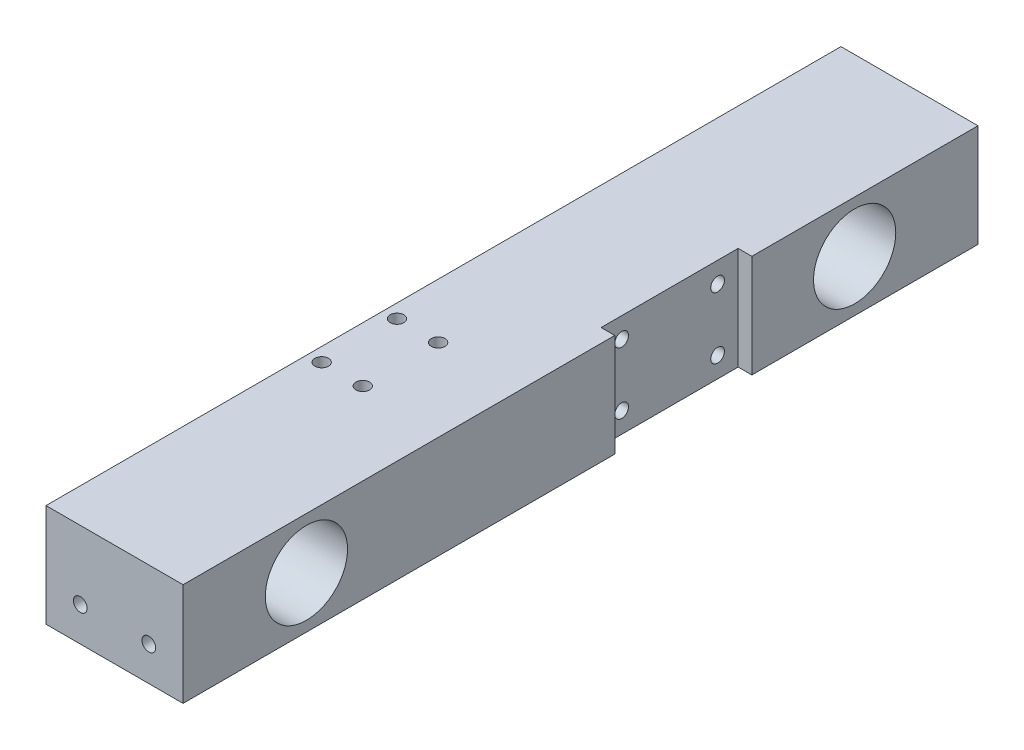
ISO-10303-21;
HEADER;
FILE_DESCRIPTION(('STEP AP214'),'2;1');
FILE_NAME('part.step','',(''),(''),'','','');
FILE_SCHEMA(('AUTOMOTIVE_DESIGN { 1 0 10303 214 1 1 1 1 }'));
ENDSEC;
DATA;
#1=APPLICATION_CONTEXT('core data for automotive mechanical design processes');
#2=APPLICATION_PROTOCOL_DEFINITION('international standard','automotive_design',2000,#1);
#3=PRODUCT_CONTEXT('',#1,'mechanical');
#4=PRODUCT('Part','Part','',(#3));
#5=PRODUCT_RELATED_PRODUCT_CATEGORY('part','',(#4));
#6=PRODUCT_DEFINITION_FORMATION('','',#4);
#7=PRODUCT_DEFINITION_CONTEXT('part definition',#1,'design');
#8=PRODUCT_DEFINITION('design','',#6,#7);
#9=PRODUCT_DEFINITION_SHAPE('','',#8);
#10=(LENGTH_UNIT() NAMED_UNIT(*) SI_UNIT(.MILLI.,.METRE.));
#11=(NAMED_UNIT(*) PLANE_ANGLE_UNIT() SI_UNIT($,.RADIAN.));
#12=(NAMED_UNIT(*) SI_UNIT($,.STERADIAN.) SOLID_ANGLE_UNIT());
#13=UNCERTAINTY_MEASURE_WITH_UNIT(LENGTH_MEASURE(1.E-05),#10,'distance_accuracy_value','');
#14=(GEOMETRIC_REPRESENTATION_CONTEXT(3) GLOBAL_UNCERTAINTY_ASSIGNED_CONTEXT((#13)) GLOBAL_UNIT_ASSIGNED_CONTEXT((#10,
#11,#12)) REPRESENTATION_CONTEXT('',''));
#15=CARTESIAN_POINT('',(0.,0.,0.));
#16=DIRECTION('',(0.,0.,1.));
#17=DIRECTION('',(1.,0.,0.));
#18=AXIS2_PLACEMENT_3D('',#15,#16,#17);
#19=CARTESIAN_POINT('',(0.,12.,50.));
#20=DIRECTION('',(1.,0.,0.));
#21=DIRECTION('',(0.,0.,-1.));
#22=AXIS2_PLACEMENT_3D('',#19,#20,#21);
#23=CYLINDRICAL_SURFACE('',#22,0.999999999999998);
#24=CARTESIAN_POINT('',(5.,12.,50.));
#25=DIRECTION('',(-1.,0.,0.));
#26=DIRECTION('',(0.,-1.,0.));
#27=AXIS2_PLACEMENT_3D('',#24,#25,#26);
#28=CIRCLE('',#27,0.999999999999998);
#29=CARTESIAN_POINT('',(5.,11.,50.));
#30=VERTEX_POINT('',#29);
#31=EDGE_CURVE('E37',#30,#30,#28,.F.);
#32=ORIENTED_EDGE('',*,*,#31,.F.);
#33=EDGE_LOOP('',(#32));
#34=FACE_BOUND('',#33,.T.);
#35=CARTESIAN_POINT('',(18.,12.,50.));
#36=DIRECTION('',(1.,0.,0.));
#37=DIRECTION('',(0.,0.,-1.));
#38=AXIS2_PLACEMENT_3D('',#35,#36,#37);
#39=CIRCLE('',#38,0.999999999999998);
#40=CARTESIAN_POINT('',(18.,12.,49.));
#41=VERTEX_POINT('',#40);
#42=EDGE_CURVE('E126',#41,#41,#39,.T.);
#43=ORIENTED_EDGE('',*,*,#42,.T.);
#44=EDGE_LOOP('',(#43));
#45=FACE_BOUND('',#44,.T.);
#46=ADVANCED_FACE('F33',(#34,#45),#23,.F.);
#47=CARTESIAN_POINT('',(0.,12.,36.));
#48=DIRECTION('',(1.,0.,0.));
#49=DIRECTION('',(0.,0.,-1.));
#50=AXIS2_PLACEMENT_3D('',#47,#48,#49);
#51=CYLINDRICAL_SURFACE('',#50,0.999999999999998);
#52=CARTESIAN_POINT('',(5.,12.,36.));
#53=DIRECTION('',(-1.,0.,0.));
#54=DIRECTION('',(0.,-1.,0.));
#55=AXIS2_PLACEMENT_3D('',#52,#53,#54);
#56=CIRCLE('',#55,0.999999999999998);
#57=CARTESIAN_POINT('',(5.,11.,36.));
#58=VERTEX_POINT('',#57);
#59=EDGE_CURVE('E291',#58,#58,#56,.T.);
#60=ORIENTED_EDGE('',*,*,#59,.T.);
#61=EDGE_LOOP('',(#60));
#62=FACE_BOUND('',#61,.T.);
#63=CARTESIAN_POINT('',(18.,12.,36.));
#64=DIRECTION('',(1.,0.,0.));
#65=DIRECTION('',(0.,0.,-1.));
#66=AXIS2_PLACEMENT_3D('',#63,#64,#65);
#67=CIRCLE('',#66,0.999999999999998);
#68=CARTESIAN_POINT('',(18.,12.,35.));
#69=VERTEX_POINT('',#68);
#70=EDGE_CURVE('E135',#69,#69,#67,.F.);
#71=ORIENTED_EDGE('',*,*,#70,.F.);
#72=EDGE_LOOP('',(#71));
#73=FACE_BOUND('',#72,.T.);
#74=ADVANCED_FACE('F302',(#62,#73),#51,.F.);
#75=CARTESIAN_POINT('',(0.,3.,36.));
#76=DIRECTION('',(1.,0.,0.));
#77=DIRECTION('',(0.,0.,-1.));
#78=AXIS2_PLACEMENT_3D('',#75,#76,#77);
#79=CYLINDRICAL_SURFACE('',#78,0.999999999999998);
#80=CARTESIAN_POINT('',(5.,3.,36.));
#81=DIRECTION('',(-1.,0.,0.));
#82=DIRECTION('',(0.,-1.,0.));
#83=AXIS2_PLACEMENT_3D('',#80,#81,#82);
#84=CIRCLE('',#83,0.999999999999998);
#85=CARTESIAN_POINT('',(5.,2.,36.));
#86=VERTEX_POINT('',#85);
#87=EDGE_CURVE('E289',#86,#86,#84,.F.);
#88=ORIENTED_EDGE('',*,*,#87,.F.);
#89=EDGE_LOOP('',(#88));
#90=FACE_BOUND('',#89,.T.);
#91=CARTESIAN_POINT('',(18.,3.,36.));
#92=DIRECTION('',(1.,0.,0.));
#93=DIRECTION('',(0.,0.,-1.));
#94=AXIS2_PLACEMENT_3D('',#91,#92,#93);
#95=CIRCLE('',#94,0.999999999999998);
#96=CARTESIAN_POINT('',(18.,3.,35.));
#97=VERTEX_POINT('',#96);
#98=EDGE_CURVE('E118',#97,#97,#95,.T.);
#99=ORIENTED_EDGE('',*,*,#98,.T.);
#100=EDGE_LOOP('',(#99));
#101=FACE_BOUND('',#100,.T.);
#102=ADVANCED_FACE('F352',(#90,#101),#79,.F.);
#103=CARTESIAN_POINT('',(0.,3.,50.));
#104=DIRECTION('',(1.,0.,0.));
#105=DIRECTION('',(0.,0.,-1.));
#106=AXIS2_PLACEMENT_3D('',#103,#104,#105);
#107=CYLINDRICAL_SURFACE('',#106,0.999999999999998);
#108=CARTESIAN_POINT('',(5.,3.,50.));
#109=DIRECTION('',(-1.,0.,0.));
#110=DIRECTION('',(0.,-1.,0.));
#111=AXIS2_PLACEMENT_3D('',#108,#109,#110);
#112=CIRCLE('',#111,0.999999999999998);
#113=CARTESIAN_POINT('',(5.,2.,50.));
#114=VERTEX_POINT('',#113);
#115=EDGE_CURVE('E174',#114,#114,#112,.T.);
#116=ORIENTED_EDGE('',*,*,#115,.T.);
#117=EDGE_LOOP('',(#116));
#118=FACE_BOUND('',#117,.T.);
#119=CARTESIAN_POINT('',(18.,3.,50.));
#120=DIRECTION('',(1.,0.,0.));
#121=DIRECTION('',(0.,0.,-1.));
#122=AXIS2_PLACEMENT_3D('',#119,#120,#121);
#123=CIRCLE('',#122,0.999999999999998);
#124=CARTESIAN_POINT('',(18.,3.,49.));
#125=VERTEX_POINT('',#124);
#126=EDGE_CURVE('E138',#125,#125,#123,.F.);
#127=ORIENTED_EDGE('',*,*,#126,.F.);
#128=EDGE_LOOP('',(#127));
#129=FACE_BOUND('',#128,.T.);
#130=ADVANCED_FACE('F355',(#118,#129),#107,.F.);
#131=CARTESIAN_POINT('',(20.,0.,116.));
#132=DIRECTION('',(-1.,0.,0.));
#133=DIRECTION('',(0.,0.,1.));
#134=AXIS2_PLACEMENT_3D('',#131,#132,#133);
#135=PLANE('',#134);
#136=CARTESIAN_POINT('',(20.,7.50000000000001,98.));
#137=DIRECTION('',(1.,0.,0.));
#138=DIRECTION('',(0.,0.,-1.));
#139=AXIS2_PLACEMENT_3D('',#136,#137,#138);
#140=CIRCLE('',#139,6.);
#141=CARTESIAN_POINT('',(20.,7.50000000000001,92.));
#142=VERTEX_POINT('',#141);
#143=EDGE_CURVE('E220',#142,#142,#140,.T.);
#144=ORIENTED_EDGE('',*,*,#143,.F.);
#145=EDGE_LOOP('',(#144));
#146=FACE_BOUND('',#145,.T.);
#147=DIRECTION('',(0.,1.,0.));
#148=VECTOR('',#147,1.);
#149=CARTESIAN_POINT('',(20.,0.,53.));
#150=LINE('',#149,#148);
#151=CARTESIAN_POINT('',(20.,0.,53.));
#152=VERTEX_POINT('',#151);
#153=CARTESIAN_POINT('',(20.,15.,53.));
#154=VERTEX_POINT('',#153);
#155=EDGE_CURVE('E113',#152,#154,#150,.T.);
#156=ORIENTED_EDGE('',*,*,#155,.T.);
#157=DIRECTION('',(0.,0.,-1.));
#158=VECTOR('',#157,1.);
#159=CARTESIAN_POINT('',(20.,15.,116.));
#160=LINE('',#159,#158);
#161=CARTESIAN_POINT('',(20.,15.,116.));
#162=VERTEX_POINT('',#161);
#163=EDGE_CURVE('E272',#162,#154,#160,.T.);
#164=ORIENTED_EDGE('',*,*,#163,.F.);
#165=DIRECTION('',(0.,1.,0.));
#166=VECTOR('',#165,1.);
#167=CARTESIAN_POINT('',(20.,0.,116.));
#168=LINE('',#167,#166);
#169=CARTESIAN_POINT('',(20.,0.,116.));
#170=VERTEX_POINT('',#169);
#171=EDGE_CURVE('E257',#170,#162,#168,.T.);
#172=ORIENTED_EDGE('',*,*,#171,.F.);
#173=DIRECTION('',(0.,0.,-1.));
#174=VECTOR('',#173,1.);
#175=CARTESIAN_POINT('',(20.,0.,116.));
#176=LINE('',#175,#174);
#177=EDGE_CURVE('E42',#170,#152,#176,.T.);
#178=ORIENTED_EDGE('',*,*,#177,.T.);
#179=EDGE_LOOP('',(#156,#164,#172,#178));
#180=FACE_BOUND('',#179,.T.);
#181=ADVANCED_FACE('F358',(#146,#180),#135,.F.);
#182=CARTESIAN_POINT('',(0.,0.,116.));
#183=DIRECTION('',(0.,1.,0.));
#184=DIRECTION('',(0.,0.,1.));
#185=AXIS2_PLACEMENT_3D('',#182,#183,#184);
#186=PLANE('',#185);
#187=CARTESIAN_POINT('',(2.,0.,77.78));
#188=DIRECTION('',(0.,-1.,0.));
#189=DIRECTION('',(0.,0.,-1.));
#190=AXIS2_PLACEMENT_3D('',#187,#188,#189);
#191=CIRCLE('',#190,1.5);
#192=CARTESIAN_POINT('',(2.,0.,76.28));
#193=VERTEX_POINT('',#192);
#194=EDGE_CURVE('E180',#193,#193,#191,.T.);
#195=ORIENTED_EDGE('',*,*,#194,.F.);
#196=EDGE_LOOP('',(#195));
#197=FACE_BOUND('',#196,.T.);
#198=CARTESIAN_POINT('',(8.,0.,77.78));
#199=DIRECTION('',(0.,-1.,0.));
#200=DIRECTION('',(0.,0.,-1.));
#201=AXIS2_PLACEMENT_3D('',#198,#199,#200);
#202=CIRCLE('',#201,1.5);
#203=CARTESIAN_POINT('',(8.,0.,76.28));
#204=VERTEX_POINT('',#203);
#205=EDGE_CURVE('E177',#204,#204,#202,.T.);
#206=ORIENTED_EDGE('',*,*,#205,.F.);
#207=EDGE_LOOP('',(#206));
#208=FACE_BOUND('',#207,.T.);
#209=CARTESIAN_POINT('',(8.,0.,66.78));
#210=DIRECTION('',(0.,-1.,0.));
#211=DIRECTION('',(0.,0.,-1.));
#212=AXIS2_PLACEMENT_3D('',#209,#210,#211);
#213=CIRCLE('',#212,1.5);
#214=CARTESIAN_POINT('',(8.,0.,65.28));
#215=VERTEX_POINT('',#214);
#216=EDGE_CURVE('E184',#215,#215,#213,.T.);
#217=ORIENTED_EDGE('',*,*,#216,.F.);
#218=EDGE_LOOP('',(#217));
#219=FACE_BOUND('',#218,.T.);
#220=CARTESIAN_POINT('',(2.,0.,66.78));
#221=DIRECTION('',(0.,-1.,0.));
#222=DIRECTION('',(0.,0.,-1.));
#223=AXIS2_PLACEMENT_3D('',#220,#221,#222);
#224=CIRCLE('',#223,1.5);
#225=CARTESIAN_POINT('',(2.,0.,65.28));
#226=VERTEX_POINT('',#225);
#227=EDGE_CURVE('E190',#226,#226,#224,.T.);
#228=ORIENTED_EDGE('',*,*,#227,.F.);
#229=EDGE_LOOP('',(#228));
#230=FACE_BOUND('',#229,.T.);
#231=DIRECTION('',(1.,0.,0.));
#232=VECTOR('',#231,1.);
#233=CARTESIAN_POINT('',(18.,0.,53.));
#234=LINE('',#233,#232);
#235=CARTESIAN_POINT('',(18.,0.,53.));
#236=VERTEX_POINT('',#235);
#237=EDGE_CURVE('E107',#236,#152,#234,.T.);
#238=ORIENTED_EDGE('',*,*,#237,.T.);
#239=ORIENTED_EDGE('',*,*,#177,.F.);
#240=DIRECTION('',(1.,0.,0.));
#241=VECTOR('',#240,1.);
#242=CARTESIAN_POINT('',(0.,0.,116.));
#243=LINE('',#242,#241);
#244=CARTESIAN_POINT('',(0.,0.,116.));
#245=VERTEX_POINT('',#244);
#246=EDGE_CURVE('E259',#245,#170,#243,.T.);
#247=ORIENTED_EDGE('',*,*,#246,.F.);
#248=DIRECTION('',(0.,0.,-1.));
#249=VECTOR('',#248,1.);
#250=CARTESIAN_POINT('',(0.,0.,116.));
#251=LINE('',#250,#249);
#252=CARTESIAN_POINT('',(0.,0.,0.));
#253=VERTEX_POINT('',#252);
#254=EDGE_CURVE('E11',#245,#253,#251,.T.);
#255=ORIENTED_EDGE('',*,*,#254,.T.);
#256=DIRECTION('',(1.,0.,0.));
#257=VECTOR('',#256,1.);
#258=CARTESIAN_POINT('',(0.,0.,0.));
#259=LINE('',#258,#257);
#260=CARTESIAN_POINT('',(20.,0.,0.));
#261=VERTEX_POINT('',#260);
#262=EDGE_CURVE('E255',#253,#261,#259,.T.);
#263=ORIENTED_EDGE('',*,*,#262,.T.);
#264=CARTESIAN_POINT('',(20.,0.,33.));
#265=VERTEX_POINT('',#264);
#266=EDGE_CURVE('E271',#265,#261,#176,.T.);
#267=ORIENTED_EDGE('',*,*,#266,.F.);
#268=DIRECTION('',(1.,0.,0.));
#269=VECTOR('',#268,1.);
#270=CARTESIAN_POINT('',(18.,0.,33.));
#271=LINE('',#270,#269);
#272=CARTESIAN_POINT('',(18.,0.,33.));
#273=VERTEX_POINT('',#272);
#274=EDGE_CURVE('E117',#273,#265,#271,.T.);
#275=ORIENTED_EDGE('',*,*,#274,.F.);
#276=DIRECTION('',(0.,0.,-1.));
#277=VECTOR('',#276,1.);
#278=CARTESIAN_POINT('',(18.,0.,0.));
#279=LINE('',#278,#277);
#280=EDGE_CURVE('E122',#236,#273,#279,.T.);
#281=ORIENTED_EDGE('',*,*,#280,.F.);
#282=EDGE_LOOP('',(#238,#239,#247,#255,#263,#267,#275,#281));
#283=FACE_BOUND('',#282,.T.);
#284=ADVANCED_FACE('F128',(#197,#208,#219,#230,#283),#186,.F.);
#285=CARTESIAN_POINT('',(0.,15.,116.));
#286=DIRECTION('',(0.,1.,0.));
#287=DIRECTION('',(-1.,0.,0.));
#288=AXIS2_PLACEMENT_3D('',#285,#286,#287);
#289=PLANE('',#288);
#290=CARTESIAN_POINT('',(8.,15.,66.78));
#291=DIRECTION('',(0.,-1.,0.));
#292=DIRECTION('',(1.,0.,0.));
#293=AXIS2_PLACEMENT_3D('',#290,#291,#292);
#294=CIRCLE('',#293,1.);
#295=CARTESIAN_POINT('',(9.00000000000001,15.,66.78));
#296=VERTEX_POINT('',#295);
#297=EDGE_CURVE('E206',#296,#296,#294,.T.);
#298=ORIENTED_EDGE('',*,*,#297,.T.);
#299=EDGE_LOOP('',(#298));
#300=FACE_BOUND('',#299,.T.);
#301=CARTESIAN_POINT('',(2.,15.,66.78));
#302=DIRECTION('',(0.,1.,0.));
#303=DIRECTION('',(-1.,0.,0.));
#304=AXIS2_PLACEMENT_3D('',#301,#302,#303);
#305=CIRCLE('',#304,1.);
#306=CARTESIAN_POINT('',(0.999999999999999,15.,66.78));
#307=VERTEX_POINT('',#306);
#308=EDGE_CURVE('E202',#307,#307,#305,.T.);
#309=ORIENTED_EDGE('',*,*,#308,.F.);
#310=EDGE_LOOP('',(#309));
#311=FACE_BOUND('',#310,.T.);
#312=CARTESIAN_POINT('',(8.,15.,77.78));
#313=DIRECTION('',(0.,1.,0.));
#314=DIRECTION('',(-1.,0.,0.));
#315=AXIS2_PLACEMENT_3D('',#312,#313,#314);
#316=CIRCLE('',#315,1.);
#317=CARTESIAN_POINT('',(7.,15.,77.78));
#318=VERTEX_POINT('',#317);
#319=EDGE_CURVE('E205',#318,#318,#316,.T.);
#320=ORIENTED_EDGE('',*,*,#319,.F.);
#321=EDGE_LOOP('',(#320));
#322=FACE_BOUND('',#321,.T.);
#323=CARTESIAN_POINT('',(2.,15.,77.78));
#324=DIRECTION('',(0.,-1.,0.));
#325=DIRECTION('',(1.,0.,0.));
#326=AXIS2_PLACEMENT_3D('',#323,#324,#325);
#327=CIRCLE('',#326,1.);
#328=CARTESIAN_POINT('',(3.,15.,77.78));
#329=VERTEX_POINT('',#328);
#330=EDGE_CURVE('E209',#329,#329,#327,.T.);
#331=ORIENTED_EDGE('',*,*,#330,.T.);
#332=EDGE_LOOP('',(#331));
#333=FACE_BOUND('',#332,.T.);
#334=ORIENTED_EDGE('',*,*,#163,.T.);
#335=DIRECTION('',(1.,0.,0.));
#336=VECTOR('',#335,1.);
#337=CARTESIAN_POINT('',(18.,15.,53.));
#338=LINE('',#337,#336);
#339=CARTESIAN_POINT('',(18.,15.,53.));
#340=VERTEX_POINT('',#339);
#341=EDGE_CURVE('E146',#340,#154,#338,.T.);
#342=ORIENTED_EDGE('',*,*,#341,.F.);
#343=DIRECTION('',(0.,0.,-1.));
#344=VECTOR('',#343,1.);
#345=CARTESIAN_POINT('',(18.,15.,0.));
#346=LINE('',#345,#344);
#347=CARTESIAN_POINT('',(18.,15.,33.));
#348=VERTEX_POINT('',#347);
#349=EDGE_CURVE('E125',#340,#348,#346,.T.);
#350=ORIENTED_EDGE('',*,*,#349,.T.);
#351=DIRECTION('',(1.,0.,0.));
#352=VECTOR('',#351,1.);
#353=CARTESIAN_POINT('',(18.,15.,33.));
#354=LINE('',#353,#352);
#355=CARTESIAN_POINT('',(20.,15.,33.));
#356=VERTEX_POINT('',#355);
#357=EDGE_CURVE('E149',#348,#356,#354,.T.);
#358=ORIENTED_EDGE('',*,*,#357,.T.);
#359=CARTESIAN_POINT('',(20.,15.,0.));
#360=VERTEX_POINT('',#359);
#361=EDGE_CURVE('E275',#356,#360,#160,.T.);
#362=ORIENTED_EDGE('',*,*,#361,.T.);
#363=DIRECTION('',(1.,0.,0.));
#364=VECTOR('',#363,1.);
#365=CARTESIAN_POINT('',(0.,15.,0.));
#366=LINE('',#365,#364);
#367=CARTESIAN_POINT('',(0.,15.,0.));
#368=VERTEX_POINT('',#367);
#369=EDGE_CURVE('E263',#368,#360,#366,.T.);
#370=ORIENTED_EDGE('',*,*,#369,.F.);
#371=DIRECTION('',(0.,0.,-1.));
#372=VECTOR('',#371,1.);
#373=CARTESIAN_POINT('',(0.,15.,116.));
#374=LINE('',#373,#372);
#375=CARTESIAN_POINT('',(0.,15.,116.));
#376=VERTEX_POINT('',#375);
#377=EDGE_CURVE('E83',#376,#368,#374,.T.);
#378=ORIENTED_EDGE('',*,*,#377,.F.);
#379=DIRECTION('',(1.,0.,0.));
#380=VECTOR('',#379,1.);
#381=CARTESIAN_POINT('',(0.,15.,116.));
#382=LINE('',#381,#380);
#383=EDGE_CURVE('E254',#376,#162,#382,.T.);
#384=ORIENTED_EDGE('',*,*,#383,.T.);
#385=EDGE_LOOP('',(#334,#342,#350,#358,#362,#370,#378,#384));
#386=FACE_BOUND('',#385,.T.);
#387=ADVANCED_FACE('F459',(#300,#311,#322,#333,#386),#289,.T.);
#388=CARTESIAN_POINT('',(0.,0.,116.));
#389=DIRECTION('',(-1.,0.,0.));
#390=DIRECTION('',(0.,-1.,0.));
#391=AXIS2_PLACEMENT_3D('',#388,#389,#390);
#392=PLANE('',#391);
#393=CARTESIAN_POINT('',(0.,12.,50.));
#394=DIRECTION('',(-1.,0.,0.));
#395=DIRECTION('',(0.,-1.,0.));
#396=AXIS2_PLACEMENT_3D('',#393,#394,#395);
#397=CIRCLE('',#396,2.);
#398=CARTESIAN_POINT('',(0.,10.,50.));
#399=VERTEX_POINT('',#398);
#400=EDGE_CURVE('E148',#399,#399,#397,.T.);
#401=ORIENTED_EDGE('',*,*,#400,.F.);
#402=EDGE_LOOP('',(#401));
#403=FACE_BOUND('',#402,.T.);
#404=CARTESIAN_POINT('',(0.,3.,50.));
#405=DIRECTION('',(-1.,0.,0.));
#406=DIRECTION('',(0.,-1.,0.));
#407=AXIS2_PLACEMENT_3D('',#404,#405,#406);
#408=CIRCLE('',#407,2.);
#409=CARTESIAN_POINT('',(0.,0.999999999999998,50.));
#410=VERTEX_POINT('',#409);
#411=EDGE_CURVE('E163',#410,#410,#408,.T.);
#412=ORIENTED_EDGE('',*,*,#411,.F.);
#413=EDGE_LOOP('',(#412));
#414=FACE_BOUND('',#413,.T.);
#415=CARTESIAN_POINT('',(0.,3.,36.));
#416=DIRECTION('',(-1.,0.,0.));
#417=DIRECTION('',(0.,-1.,0.));
#418=AXIS2_PLACEMENT_3D('',#415,#416,#417);
#419=CIRCLE('',#418,2.);
#420=CARTESIAN_POINT('',(0.,0.999999999999998,36.));
#421=VERTEX_POINT('',#420);
#422=EDGE_CURVE('E157',#421,#421,#419,.T.);
#423=ORIENTED_EDGE('',*,*,#422,.F.);
#424=EDGE_LOOP('',(#423));
#425=FACE_BOUND('',#424,.T.);
#426=CARTESIAN_POINT('',(0.,12.,36.));
#427=DIRECTION('',(-1.,0.,0.));
#428=DIRECTION('',(0.,-1.,0.));
#429=AXIS2_PLACEMENT_3D('',#426,#427,#428);
#430=CIRCLE('',#429,2.);
#431=CARTESIAN_POINT('',(0.,10.,36.));
#432=VERTEX_POINT('',#431);
#433=EDGE_CURVE('E156',#432,#432,#430,.T.);
#434=ORIENTED_EDGE('',*,*,#433,.F.);
#435=EDGE_LOOP('',(#434));
#436=FACE_BOUND('',#435,.T.);
#437=DIRECTION('',(0.,1.,0.));
#438=VECTOR('',#437,1.);
#439=CARTESIAN_POINT('',(0.,0.,0.));
#440=LINE('',#439,#438);
#441=EDGE_CURVE('E243',#253,#368,#440,.T.);
#442=ORIENTED_EDGE('',*,*,#441,.F.);
#443=ORIENTED_EDGE('',*,*,#254,.F.);
#444=DIRECTION('',(0.,1.,0.));
#445=VECTOR('',#444,1.);
#446=CARTESIAN_POINT('',(0.,0.,116.));
#447=LINE('',#446,#445);
#448=EDGE_CURVE('E252',#245,#376,#447,.T.);
#449=ORIENTED_EDGE('',*,*,#448,.T.);
#450=ORIENTED_EDGE('',*,*,#377,.T.);
#451=EDGE_LOOP('',(#442,#443,#449,#450));
#452=FACE_BOUND('',#451,.T.);
#453=CARTESIAN_POINT('',(0.,7.50000000000002,18.));
#454=DIRECTION('',(1.,0.,0.));
#455=DIRECTION('',(0.,0.,-1.));
#456=AXIS2_PLACEMENT_3D('',#453,#454,#455);
#457=CIRCLE('',#456,6.);
#458=CARTESIAN_POINT('',(0.,7.50000000000002,12.));
#459=VERTEX_POINT('',#458);
#460=EDGE_CURVE('E223',#459,#459,#457,.F.);
#461=ORIENTED_EDGE('',*,*,#460,.F.);
#462=EDGE_LOOP('',(#461));
#463=FACE_BOUND('',#462,.T.);
#464=CARTESIAN_POINT('',(0.,7.50000000000001,98.));
#465=DIRECTION('',(1.,0.,0.));
#466=DIRECTION('',(0.,0.,-1.));
#467=AXIS2_PLACEMENT_3D('',#464,#465,#466);
#468=CIRCLE('',#467,6.);
#469=CARTESIAN_POINT('',(0.,7.50000000000001,92.));
#470=VERTEX_POINT('',#469);
#471=EDGE_CURVE('E216',#470,#470,#468,.T.);
#472=ORIENTED_EDGE('',*,*,#471,.T.);
#473=EDGE_LOOP('',(#472));
#474=FACE_BOUND('',#473,.T.);
#475=ADVANCED_FACE('F35',(#403,#414,#425,#436,#452,#463,#474),#392,.T.);
#476=ORIENTED_EDGE('',*,*,#361,.F.);
#477=DIRECTION('',(0.,1.,0.));
#478=VECTOR('',#477,1.);
#479=CARTESIAN_POINT('',(20.,0.,33.));
#480=LINE('',#479,#478);
#481=EDGE_CURVE('E144',#265,#356,#480,.T.);
#482=ORIENTED_EDGE('',*,*,#481,.F.);
#483=ORIENTED_EDGE('',*,*,#266,.T.);
#484=DIRECTION('',(0.,1.,0.));
#485=VECTOR('',#484,1.);
#486=CARTESIAN_POINT('',(20.,0.,0.));
#487=LINE('',#486,#485);
#488=EDGE_CURVE('E266',#261,#360,#487,.T.);
#489=ORIENTED_EDGE('',*,*,#488,.T.);
#490=EDGE_LOOP('',(#476,#482,#483,#489));
#491=FACE_BOUND('',#490,.T.);
#492=CARTESIAN_POINT('',(20.,7.50000000000002,18.));
#493=DIRECTION('',(1.,0.,0.));
#494=DIRECTION('',(0.,0.,-1.));
#495=AXIS2_PLACEMENT_3D('',#492,#493,#494);
#496=CIRCLE('',#495,6.);
#497=CARTESIAN_POINT('',(20.,7.50000000000002,12.));
#498=VERTEX_POINT('',#497);
#499=EDGE_CURVE('E215',#498,#498,#496,.F.);
#500=ORIENTED_EDGE('',*,*,#499,.T.);
#501=EDGE_LOOP('',(#500));
#502=FACE_BOUND('',#501,.T.);
#503=ADVANCED_FACE('F409',(#491,#502),#135,.F.);
#504=CARTESIAN_POINT('',(8.,0.,77.78));
#505=DIRECTION('',(0.,1.,0.));
#506=DIRECTION('',(-1.,0.,0.));
#507=AXIS2_PLACEMENT_3D('',#504,#505,#506);
#508=CYLINDRICAL_SURFACE('',#507,1.);
#509=ORIENTED_EDGE('',*,*,#319,.T.);
#510=EDGE_LOOP('',(#509));
#511=FACE_BOUND('',#510,.T.);
#512=CARTESIAN_POINT('',(8.,5.,77.78));
#513=DIRECTION('',(0.,-1.,0.));
#514=DIRECTION('',(0.,0.,-1.));
#515=AXIS2_PLACEMENT_3D('',#512,#513,#514);
#516=CIRCLE('',#515,1.);
#517=CARTESIAN_POINT('',(8.,5.,76.78));
#518=VERTEX_POINT('',#517);
#519=EDGE_CURVE('E212',#518,#518,#516,.F.);
#520=ORIENTED_EDGE('',*,*,#519,.F.);
#521=EDGE_LOOP('',(#520));
#522=FACE_BOUND('',#521,.T.);
#523=ADVANCED_FACE('F397',(#511,#522),#508,.F.);
#524=CARTESIAN_POINT('',(2.,0.,66.78));
#525=DIRECTION('',(0.,1.,0.));
#526=DIRECTION('',(-1.,0.,0.));
#527=AXIS2_PLACEMENT_3D('',#524,#525,#526);
#528=CYLINDRICAL_SURFACE('',#527,1.);
#529=ORIENTED_EDGE('',*,*,#308,.T.);
#530=EDGE_LOOP('',(#529));
#531=FACE_BOUND('',#530,.T.);
#532=CARTESIAN_POINT('',(2.,5.,66.78));
#533=DIRECTION('',(0.,-1.,0.));
#534=DIRECTION('',(0.,0.,-1.));
#535=AXIS2_PLACEMENT_3D('',#532,#533,#534);
#536=CIRCLE('',#535,1.);
#537=CARTESIAN_POINT('',(2.,5.,65.78));
#538=VERTEX_POINT('',#537);
#539=EDGE_CURVE('E282',#538,#538,#536,.F.);
#540=ORIENTED_EDGE('',*,*,#539,.F.);
#541=EDGE_LOOP('',(#540));
#542=FACE_BOUND('',#541,.T.);
#543=ADVANCED_FACE('F393',(#531,#542),#528,.F.);
#544=CARTESIAN_POINT('',(8.,0.,66.78));
#545=DIRECTION('',(0.,1.,0.));
#546=DIRECTION('',(-1.,0.,0.));
#547=AXIS2_PLACEMENT_3D('',#544,#545,#546);
#548=CYLINDRICAL_SURFACE('',#547,1.);
#549=ORIENTED_EDGE('',*,*,#297,.F.);
#550=EDGE_LOOP('',(#549));
#551=FACE_BOUND('',#550,.T.);
#552=CARTESIAN_POINT('',(8.,5.,66.78));
#553=DIRECTION('',(0.,-1.,0.));
#554=DIRECTION('',(0.,0.,-1.));
#555=AXIS2_PLACEMENT_3D('',#552,#553,#554);
#556=CIRCLE('',#555,1.);
#557=CARTESIAN_POINT('',(8.,5.,65.78));
#558=VERTEX_POINT('',#557);
#559=EDGE_CURVE('E279',#558,#558,#556,.T.);
#560=ORIENTED_EDGE('',*,*,#559,.T.);
#561=EDGE_LOOP('',(#560));
#562=FACE_BOUND('',#561,.T.);
#563=ADVANCED_FACE('F396',(#551,#562),#548,.F.);
#564=CARTESIAN_POINT('',(2.,0.,77.78));
#565=DIRECTION('',(0.,1.,0.));
#566=DIRECTION('',(-1.,0.,0.));
#567=AXIS2_PLACEMENT_3D('',#564,#565,#566);
#568=CYLINDRICAL_SURFACE('',#567,1.);
#569=ORIENTED_EDGE('',*,*,#330,.F.);
#570=EDGE_LOOP('',(#569));
#571=FACE_BOUND('',#570,.T.);
#572=CARTESIAN_POINT('',(2.,5.,77.78));
#573=DIRECTION('',(0.,-1.,0.));
#574=DIRECTION('',(0.,0.,-1.));
#575=AXIS2_PLACEMENT_3D('',#572,#573,#574);
#576=CIRCLE('',#575,1.);
#577=CARTESIAN_POINT('',(2.,5.,76.78));
#578=VERTEX_POINT('',#577);
#579=EDGE_CURVE('E199',#578,#578,#576,.T.);
#580=ORIENTED_EDGE('',*,*,#579,.T.);
#581=EDGE_LOOP('',(#580));
#582=FACE_BOUND('',#581,.T.);
#583=ADVANCED_FACE('F401',(#571,#582),#568,.F.);
#584=CARTESIAN_POINT('',(0.,0.,116.));
#585=DIRECTION('',(0.,0.,-1.));
#586=DIRECTION('',(-1.,0.,0.));
#587=AXIS2_PLACEMENT_3D('',#584,#585,#586);
#588=PLANE('',#587);
#589=CARTESIAN_POINT('',(5.,5.00000000000001,116.));
#590=DIRECTION('',(0.,0.,1.));
#591=DIRECTION('',(1.,0.,0.));
#592=AXIS2_PLACEMENT_3D('',#589,#590,#591);
#593=CIRCLE('',#592,1.);
#594=CARTESIAN_POINT('',(6.,5.00000000000001,116.));
#595=VERTEX_POINT('',#594);
#596=EDGE_CURVE('E235',#595,#595,#593,.T.);
#597=ORIENTED_EDGE('',*,*,#596,.F.);
#598=EDGE_LOOP('',(#597));
#599=FACE_BOUND('',#598,.T.);
#600=ORIENTED_EDGE('',*,*,#448,.F.);
#601=ORIENTED_EDGE('',*,*,#246,.T.);
#602=ORIENTED_EDGE('',*,*,#171,.T.);
#603=ORIENTED_EDGE('',*,*,#383,.F.);
#604=EDGE_LOOP('',(#600,#601,#602,#603));
#605=FACE_BOUND('',#604,.T.);
#606=CARTESIAN_POINT('',(15.,5.00000000000001,116.));
#607=DIRECTION('',(0.,0.,-1.));
#608=DIRECTION('',(-1.,0.,0.));
#609=AXIS2_PLACEMENT_3D('',#606,#607,#608);
#610=CIRCLE('',#609,1.);
#611=CARTESIAN_POINT('',(14.,5.00000000000001,116.));
#612=VERTEX_POINT('',#611);
#613=EDGE_CURVE('E232',#612,#612,#610,.T.);
#614=ORIENTED_EDGE('',*,*,#613,.T.);
#615=EDGE_LOOP('',(#614));
#616=FACE_BOUND('',#615,.T.);
#617=ADVANCED_FACE('F405',(#599,#605,#616),#588,.F.);
#618=CARTESIAN_POINT('',(0.,0.,0.));
#619=DIRECTION('',(0.,0.,-1.));
#620=DIRECTION('',(-1.,0.,0.));
#621=AXIS2_PLACEMENT_3D('',#618,#619,#620);
#622=PLANE('',#621);
#623=ORIENTED_EDGE('',*,*,#441,.T.);
#624=ORIENTED_EDGE('',*,*,#369,.T.);
#625=ORIENTED_EDGE('',*,*,#488,.F.);
#626=ORIENTED_EDGE('',*,*,#262,.F.);
#627=EDGE_LOOP('',(#623,#624,#625,#626));
#628=FACE_BOUND('',#627,.T.);
#629=CARTESIAN_POINT('',(5.,5.00000000000001,0.));
#630=DIRECTION('',(0.,0.,-1.));
#631=DIRECTION('',(-1.,0.,0.));
#632=AXIS2_PLACEMENT_3D('',#629,#630,#631);
#633=CIRCLE('',#632,1.);
#634=CARTESIAN_POINT('',(4.,5.00000000000001,0.));
#635=VERTEX_POINT('',#634);
#636=EDGE_CURVE('E247',#635,#635,#633,.T.);
#637=ORIENTED_EDGE('',*,*,#636,.F.);
#638=EDGE_LOOP('',(#637));
#639=FACE_BOUND('',#638,.T.);
#640=CARTESIAN_POINT('',(15.,5.00000000000001,0.));
#641=DIRECTION('',(0.,0.,1.));
#642=DIRECTION('',(1.,0.,0.));
#643=AXIS2_PLACEMENT_3D('',#640,#641,#642);
#644=CIRCLE('',#643,1.);
#645=CARTESIAN_POINT('',(16.,5.00000000000001,0.));
#646=VERTEX_POINT('',#645);
#647=EDGE_CURVE('E244',#646,#646,#644,.T.);
#648=ORIENTED_EDGE('',*,*,#647,.T.);
#649=EDGE_LOOP('',(#648));
#650=FACE_BOUND('',#649,.T.);
#651=ADVANCED_FACE('F446',(#628,#639,#650),#622,.T.);
#652=CARTESIAN_POINT('',(5.,5.00000000000001,10.));
#653=DIRECTION('',(0.,0.,-1.));
#654=DIRECTION('',(-1.,0.,0.));
#655=AXIS2_PLACEMENT_3D('',#652,#653,#654);
#656=CYLINDRICAL_SURFACE('',#655,1.);
#657=CARTESIAN_POINT('',(5.,5.00000000000001,10.));
#658=DIRECTION('',(0.,0.,-1.));
#659=DIRECTION('',(-1.,0.,0.));
#660=AXIS2_PLACEMENT_3D('',#657,#658,#659);
#661=CIRCLE('',#660,1.);
#662=CARTESIAN_POINT('',(4.,5.00000000000001,10.));
#663=VERTEX_POINT('',#662);
#664=EDGE_CURVE('E231',#663,#663,#661,.T.);
#665=ORIENTED_EDGE('',*,*,#664,.F.);
#666=EDGE_LOOP('',(#665));
#667=FACE_BOUND('',#666,.T.);
#668=ORIENTED_EDGE('',*,*,#636,.T.);
#669=EDGE_LOOP('',(#668));
#670=FACE_BOUND('',#669,.T.);
#671=ADVANCED_FACE('F443',(#667,#670),#656,.F.);
#672=CARTESIAN_POINT('',(5.,5.00000000000001,10.));
#673=DIRECTION('',(0.,0.,-1.));
#674=DIRECTION('',(-1.,0.,0.));
#675=AXIS2_PLACEMENT_3D('',#672,#673,#674);
#676=PLANE('',#675);
#677=ORIENTED_EDGE('',*,*,#664,.T.);
#678=EDGE_LOOP('',(#677));
#679=FACE_BOUND('',#678,.T.);
#680=ADVANCED_FACE('F441',(#679),#676,.T.);
#681=CARTESIAN_POINT('',(15.,5.00000000000001,10.));
#682=DIRECTION('',(0.,0.,-1.));
#683=DIRECTION('',(-1.,0.,0.));
#684=AXIS2_PLACEMENT_3D('',#681,#682,#683);
#685=CYLINDRICAL_SURFACE('',#684,1.);
#686=CARTESIAN_POINT('',(15.,5.00000000000001,10.));
#687=DIRECTION('',(0.,0.,1.));
#688=DIRECTION('',(1.,0.,0.));
#689=AXIS2_PLACEMENT_3D('',#686,#687,#688);
#690=CIRCLE('',#689,1.);
#691=CARTESIAN_POINT('',(16.,5.00000000000001,10.));
#692=VERTEX_POINT('',#691);
#693=EDGE_CURVE('E240',#692,#692,#690,.T.);
#694=ORIENTED_EDGE('',*,*,#693,.T.);
#695=EDGE_LOOP('',(#694));
#696=FACE_BOUND('',#695,.T.);
#697=ORIENTED_EDGE('',*,*,#647,.F.);
#698=EDGE_LOOP('',(#697));
#699=FACE_BOUND('',#698,.T.);
#700=ADVANCED_FACE('F437',(#696,#699),#685,.F.);
#701=CARTESIAN_POINT('',(15.,5.00000000000001,10.));
#702=DIRECTION('',(0.,0.,1.));
#703=DIRECTION('',(1.,0.,0.));
#704=AXIS2_PLACEMENT_3D('',#701,#702,#703);
#705=PLANE('',#704);
#706=ORIENTED_EDGE('',*,*,#693,.F.);
#707=EDGE_LOOP('',(#706));
#708=FACE_BOUND('',#707,.T.);
#709=ADVANCED_FACE('F430',(#708),#705,.F.);
#710=CARTESIAN_POINT('',(5.,5.00000000000001,106.));
#711=DIRECTION('',(0.,0.,1.));
#712=DIRECTION('',(1.,0.,0.));
#713=AXIS2_PLACEMENT_3D('',#710,#711,#712);
#714=CYLINDRICAL_SURFACE('',#713,1.);
#715=CARTESIAN_POINT('',(5.,5.00000000000001,106.));
#716=DIRECTION('',(0.,0.,1.));
#717=DIRECTION('',(1.,0.,0.));
#718=AXIS2_PLACEMENT_3D('',#715,#716,#717);
#719=CIRCLE('',#718,1.);
#720=CARTESIAN_POINT('',(6.,5.00000000000001,106.));
#721=VERTEX_POINT('',#720);
#722=EDGE_CURVE('E219',#721,#721,#719,.T.);
#723=ORIENTED_EDGE('',*,*,#722,.F.);
#724=EDGE_LOOP('',(#723));
#725=FACE_BOUND('',#724,.T.);
#726=ORIENTED_EDGE('',*,*,#596,.T.);
#727=EDGE_LOOP('',(#726));
#728=FACE_BOUND('',#727,.T.);
#729=ADVANCED_FACE('F427',(#725,#728),#714,.F.);
#730=CARTESIAN_POINT('',(5.,5.00000000000001,106.));
#731=DIRECTION('',(0.,0.,1.));
#732=DIRECTION('',(1.,0.,0.));
#733=AXIS2_PLACEMENT_3D('',#730,#731,#732);
#734=PLANE('',#733);
#735=ORIENTED_EDGE('',*,*,#722,.T.);
#736=EDGE_LOOP('',(#735));
#737=FACE_BOUND('',#736,.T.);
#738=ADVANCED_FACE('F425',(#737),#734,.T.);
#739=CARTESIAN_POINT('',(15.,5.00000000000001,106.));
#740=DIRECTION('',(0.,0.,1.));
#741=DIRECTION('',(1.,0.,0.));
#742=AXIS2_PLACEMENT_3D('',#739,#740,#741);
#743=CYLINDRICAL_SURFACE('',#742,1.);
#744=CARTESIAN_POINT('',(15.,5.00000000000001,106.));
#745=DIRECTION('',(0.,0.,-1.));
#746=DIRECTION('',(-1.,0.,0.));
#747=AXIS2_PLACEMENT_3D('',#744,#745,#746);
#748=CIRCLE('',#747,1.);
#749=CARTESIAN_POINT('',(14.,5.00000000000001,106.));
#750=VERTEX_POINT('',#749);
#751=EDGE_CURVE('E228',#750,#750,#748,.T.);
#752=ORIENTED_EDGE('',*,*,#751,.T.);
#753=EDGE_LOOP('',(#752));
#754=FACE_BOUND('',#753,.T.);
#755=ORIENTED_EDGE('',*,*,#613,.F.);
#756=EDGE_LOOP('',(#755));
#757=FACE_BOUND('',#756,.T.);
#758=ADVANCED_FACE('F421',(#754,#757),#743,.F.);
#759=CARTESIAN_POINT('',(15.,5.00000000000001,106.));
#760=DIRECTION('',(0.,0.,-1.));
#761=DIRECTION('',(-1.,0.,0.));
#762=AXIS2_PLACEMENT_3D('',#759,#760,#761);
#763=PLANE('',#762);
#764=ORIENTED_EDGE('',*,*,#751,.F.);
#765=EDGE_LOOP('',(#764));
#766=FACE_BOUND('',#765,.T.);
#767=ADVANCED_FACE('F417',(#766),#763,.F.);
#768=CARTESIAN_POINT('',(0.,7.50000000000002,18.));
#769=DIRECTION('',(1.,0.,0.));
#770=DIRECTION('',(0.,0.,-1.));
#771=AXIS2_PLACEMENT_3D('',#768,#769,#770);
#772=CYLINDRICAL_SURFACE('',#771,6.);
#773=ORIENTED_EDGE('',*,*,#460,.T.);
#774=EDGE_LOOP('',(#773));
#775=FACE_BOUND('',#774,.T.);
#776=ORIENTED_EDGE('',*,*,#499,.F.);
#777=EDGE_LOOP('',(#776));
#778=FACE_BOUND('',#777,.T.);
#779=ADVANCED_FACE('F413',(#775,#778),#772,.F.);
#780=CARTESIAN_POINT('',(0.,7.50000000000001,98.));
#781=DIRECTION('',(1.,0.,0.));
#782=DIRECTION('',(0.,0.,-1.));
#783=AXIS2_PLACEMENT_3D('',#780,#781,#782);
#784=CYLINDRICAL_SURFACE('',#783,6.);
#785=ORIENTED_EDGE('',*,*,#471,.F.);
#786=EDGE_LOOP('',(#785));
#787=FACE_BOUND('',#786,.T.);
#788=ORIENTED_EDGE('',*,*,#143,.T.);
#789=EDGE_LOOP('',(#788));
#790=FACE_BOUND('',#789,.T.);
#791=ADVANCED_FACE('F391',(#787,#790),#784,.F.);
#792=CARTESIAN_POINT('',(2.,5.,77.78));
#793=DIRECTION('',(0.,-1.,0.));
#794=DIRECTION('',(0.,0.,-1.));
#795=AXIS2_PLACEMENT_3D('',#792,#793,#794);
#796=CYLINDRICAL_SURFACE('',#795,1.5);
#797=CARTESIAN_POINT('',(2.,5.,77.78));
#798=DIRECTION('',(0.,-1.,0.));
#799=DIRECTION('',(0.,0.,-1.));
#800=AXIS2_PLACEMENT_3D('',#797,#798,#799);
#801=CIRCLE('',#800,1.5);
#802=CARTESIAN_POINT('',(2.,5.,76.28));
#803=VERTEX_POINT('',#802);
#804=EDGE_CURVE('E196',#803,#803,#801,.T.);
#805=ORIENTED_EDGE('',*,*,#804,.F.);
#806=EDGE_LOOP('',(#805));
#807=FACE_BOUND('',#806,.T.);
#808=ORIENTED_EDGE('',*,*,#194,.T.);
#809=EDGE_LOOP('',(#808));
#810=FACE_BOUND('',#809,.T.);
#811=ADVANCED_FACE('F387',(#807,#810),#796,.F.);
#812=CARTESIAN_POINT('',(2.,5.,77.78));
#813=DIRECTION('',(0.,-1.,0.));
#814=DIRECTION('',(0.,0.,-1.));
#815=AXIS2_PLACEMENT_3D('',#812,#813,#814);
#816=PLANE('',#815);
#817=ORIENTED_EDGE('',*,*,#579,.F.);
#818=EDGE_LOOP('',(#817));
#819=FACE_BOUND('',#818,.T.);
#820=ORIENTED_EDGE('',*,*,#804,.T.);
#821=EDGE_LOOP('',(#820));
#822=FACE_BOUND('',#821,.T.);
#823=ADVANCED_FACE('F373',(#819,#822),#816,.T.);
#824=CARTESIAN_POINT('',(8.,5.,66.78));
#825=DIRECTION('',(0.,-1.,0.));
#826=DIRECTION('',(0.,0.,-1.));
#827=AXIS2_PLACEMENT_3D('',#824,#825,#826);
#828=CYLINDRICAL_SURFACE('',#827,1.5);
#829=CARTESIAN_POINT('',(8.,5.,66.78));
#830=DIRECTION('',(0.,-1.,0.));
#831=DIRECTION('',(0.,0.,-1.));
#832=AXIS2_PLACEMENT_3D('',#829,#830,#831);
#833=CIRCLE('',#832,1.5);
#834=CARTESIAN_POINT('',(8.,5.,65.28));
#835=VERTEX_POINT('',#834);
#836=EDGE_CURVE('E187',#835,#835,#833,.T.);
#837=ORIENTED_EDGE('',*,*,#836,.F.);
#838=EDGE_LOOP('',(#837));
#839=FACE_BOUND('',#838,.T.);
#840=ORIENTED_EDGE('',*,*,#216,.T.);
#841=EDGE_LOOP('',(#840));
#842=FACE_BOUND('',#841,.T.);
#843=ADVANCED_FACE('F369',(#839,#842),#828,.F.);
#844=CARTESIAN_POINT('',(8.,5.,66.78));
#845=DIRECTION('',(0.,-1.,0.));
#846=DIRECTION('',(0.,0.,-1.));
#847=AXIS2_PLACEMENT_3D('',#844,#845,#846);
#848=PLANE('',#847);
#849=ORIENTED_EDGE('',*,*,#559,.F.);
#850=EDGE_LOOP('',(#849));
#851=FACE_BOUND('',#850,.T.);
#852=ORIENTED_EDGE('',*,*,#836,.T.);
#853=EDGE_LOOP('',(#852));
#854=FACE_BOUND('',#853,.T.);
#855=ADVANCED_FACE('F372',(#851,#854),#848,.T.);
#856=CARTESIAN_POINT('',(2.,5.,66.78));
#857=DIRECTION('',(0.,-1.,0.));
#858=DIRECTION('',(0.,0.,-1.));
#859=AXIS2_PLACEMENT_3D('',#856,#857,#858);
#860=PLANE('',#859);
#861=CARTESIAN_POINT('',(2.,5.,66.78));
#862=DIRECTION('',(0.,-1.,0.));
#863=DIRECTION('',(0.,0.,-1.));
#864=AXIS2_PLACEMENT_3D('',#861,#862,#863);
#865=CIRCLE('',#864,1.5);
#866=CARTESIAN_POINT('',(2.,5.,65.28));
#867=VERTEX_POINT('',#866);
#868=EDGE_CURVE('E193',#867,#867,#865,.T.);
#869=ORIENTED_EDGE('',*,*,#868,.T.);
#870=EDGE_LOOP('',(#869));
#871=FACE_BOUND('',#870,.T.);
#872=ORIENTED_EDGE('',*,*,#539,.T.);
#873=EDGE_LOOP('',(#872));
#874=FACE_BOUND('',#873,.T.);
#875=ADVANCED_FACE('F377',(#871,#874),#860,.T.);
#876=CARTESIAN_POINT('',(2.,5.,66.78));
#877=DIRECTION('',(0.,-1.,0.));
#878=DIRECTION('',(0.,0.,-1.));
#879=AXIS2_PLACEMENT_3D('',#876,#877,#878);
#880=CYLINDRICAL_SURFACE('',#879,1.5);
#881=ORIENTED_EDGE('',*,*,#868,.F.);
#882=EDGE_LOOP('',(#881));
#883=FACE_BOUND('',#882,.T.);
#884=ORIENTED_EDGE('',*,*,#227,.T.);
#885=EDGE_LOOP('',(#884));
#886=FACE_BOUND('',#885,.T.);
#887=ADVANCED_FACE('F367',(#883,#886),#880,.F.);
#888=CARTESIAN_POINT('',(8.,5.,77.78));
#889=DIRECTION('',(0.,-1.,0.));
#890=DIRECTION('',(0.,0.,-1.));
#891=AXIS2_PLACEMENT_3D('',#888,#889,#890);
#892=PLANE('',#891);
#893=CARTESIAN_POINT('',(8.,5.,77.78));
#894=DIRECTION('',(0.,-1.,0.));
#895=DIRECTION('',(0.,0.,-1.));
#896=AXIS2_PLACEMENT_3D('',#893,#894,#895);
#897=CIRCLE('',#896,1.5);
#898=CARTESIAN_POINT('',(8.,5.,76.28));
#899=VERTEX_POINT('',#898);
#900=EDGE_CURVE('E181',#899,#899,#897,.T.);
#901=ORIENTED_EDGE('',*,*,#900,.T.);
#902=EDGE_LOOP('',(#901));
#903=FACE_BOUND('',#902,.T.);
#904=ORIENTED_EDGE('',*,*,#519,.T.);
#905=EDGE_LOOP('',(#904));
#906=FACE_BOUND('',#905,.T.);
#907=ADVANCED_FACE('F363',(#903,#906),#892,.T.);
#908=CARTESIAN_POINT('',(8.,5.,77.78));
#909=DIRECTION('',(0.,-1.,0.));
#910=DIRECTION('',(0.,0.,-1.));
#911=AXIS2_PLACEMENT_3D('',#908,#909,#910);
#912=CYLINDRICAL_SURFACE('',#911,1.5);
#913=ORIENTED_EDGE('',*,*,#900,.F.);
#914=EDGE_LOOP('',(#913));
#915=FACE_BOUND('',#914,.T.);
#916=ORIENTED_EDGE('',*,*,#205,.T.);
#917=EDGE_LOOP('',(#916));
#918=FACE_BOUND('',#917,.T.);
#919=ADVANCED_FACE('F335',(#915,#918),#912,.F.);
#920=CARTESIAN_POINT('',(5.,3.,50.));
#921=DIRECTION('',(-1.,0.,0.));
#922=DIRECTION('',(0.,-1.,0.));
#923=AXIS2_PLACEMENT_3D('',#920,#921,#922);
#924=CYLINDRICAL_SURFACE('',#923,2.);
#925=CARTESIAN_POINT('',(5.,3.,50.));
#926=DIRECTION('',(-1.,0.,0.));
#927=DIRECTION('',(0.,-1.,0.));
#928=AXIS2_PLACEMENT_3D('',#925,#926,#927);
#929=CIRCLE('',#928,2.);
#930=CARTESIAN_POINT('',(5.,0.999999999999997,50.));
#931=VERTEX_POINT('',#930);
#932=EDGE_CURVE('E160',#931,#931,#929,.T.);
#933=ORIENTED_EDGE('',*,*,#932,.F.);
#934=EDGE_LOOP('',(#933));
#935=FACE_BOUND('',#934,.T.);
#936=ORIENTED_EDGE('',*,*,#411,.T.);
#937=EDGE_LOOP('',(#936));
#938=FACE_BOUND('',#937,.T.);
#939=ADVANCED_FACE('F331',(#935,#938),#924,.F.);
#940=CARTESIAN_POINT('',(5.,3.,50.));
#941=DIRECTION('',(-1.,0.,0.));
#942=DIRECTION('',(0.,-1.,0.));
#943=AXIS2_PLACEMENT_3D('',#940,#941,#942);
#944=PLANE('',#943);
#945=ORIENTED_EDGE('',*,*,#115,.F.);
#946=EDGE_LOOP('',(#945));
#947=FACE_BOUND('',#946,.T.);
#948=ORIENTED_EDGE('',*,*,#932,.T.);
#949=EDGE_LOOP('',(#948));
#950=FACE_BOUND('',#949,.T.);
#951=ADVANCED_FACE('F323',(#947,#950),#944,.T.);
#952=CARTESIAN_POINT('',(5.,3.,36.));
#953=DIRECTION('',(-1.,0.,0.));
#954=DIRECTION('',(0.,-1.,0.));
#955=AXIS2_PLACEMENT_3D('',#952,#953,#954);
#956=PLANE('',#955);
#957=CARTESIAN_POINT('',(5.,3.,36.));
#958=DIRECTION('',(-1.,0.,0.));
#959=DIRECTION('',(0.,-1.,0.));
#960=AXIS2_PLACEMENT_3D('',#957,#958,#959);
#961=CIRCLE('',#960,2.);
#962=CARTESIAN_POINT('',(5.,0.999999999999997,36.));
#963=VERTEX_POINT('',#962);
#964=EDGE_CURVE('E153',#963,#963,#961,.T.);
#965=ORIENTED_EDGE('',*,*,#964,.T.);
#966=EDGE_LOOP('',(#965));
#967=FACE_BOUND('',#966,.T.);
#968=ORIENTED_EDGE('',*,*,#87,.T.);
#969=EDGE_LOOP('',(#968));
#970=FACE_BOUND('',#969,.T.);
#971=ADVANCED_FACE('F319',(#967,#970),#956,.T.);
#972=CARTESIAN_POINT('',(5.,3.,36.));
#973=DIRECTION('',(-1.,0.,0.));
#974=DIRECTION('',(0.,-1.,0.));
#975=AXIS2_PLACEMENT_3D('',#972,#973,#974);
#976=CYLINDRICAL_SURFACE('',#975,2.);
#977=ORIENTED_EDGE('',*,*,#964,.F.);
#978=EDGE_LOOP('',(#977));
#979=FACE_BOUND('',#978,.T.);
#980=ORIENTED_EDGE('',*,*,#422,.T.);
#981=EDGE_LOOP('',(#980));
#982=FACE_BOUND('',#981,.T.);
#983=ADVANCED_FACE('F322',(#979,#982),#976,.F.);
#984=CARTESIAN_POINT('',(5.,12.,36.));
#985=DIRECTION('',(-1.,0.,0.));
#986=DIRECTION('',(0.,-1.,0.));
#987=AXIS2_PLACEMENT_3D('',#984,#985,#986);
#988=CYLINDRICAL_SURFACE('',#987,2.);
#989=CARTESIAN_POINT('',(5.,12.,36.));
#990=DIRECTION('',(-1.,0.,0.));
#991=DIRECTION('',(0.,-1.,0.));
#992=AXIS2_PLACEMENT_3D('',#989,#990,#991);
#993=CIRCLE('',#992,2.);
#994=CARTESIAN_POINT('',(5.,10.,36.));
#995=VERTEX_POINT('',#994);
#996=EDGE_CURVE('E171',#995,#995,#993,.T.);
#997=ORIENTED_EDGE('',*,*,#996,.F.);
#998=EDGE_LOOP('',(#997));
#999=FACE_BOUND('',#998,.T.);
#1000=ORIENTED_EDGE('',*,*,#433,.T.);
#1001=EDGE_LOOP('',(#1000));
#1002=FACE_BOUND('',#1001,.T.);
#1003=ADVANCED_FACE('F327',(#999,#1002),#988,.F.);
#1004=CARTESIAN_POINT('',(5.,12.,36.));
#1005=DIRECTION('',(-1.,0.,0.));
#1006=DIRECTION('',(0.,-1.,0.));
#1007=AXIS2_PLACEMENT_3D('',#1004,#1005,#1006);
#1008=PLANE('',#1007);
#1009=ORIENTED_EDGE('',*,*,#59,.F.);
#1010=EDGE_LOOP('',(#1009));
#1011=FACE_BOUND('',#1010,.T.);
#1012=ORIENTED_EDGE('',*,*,#996,.T.);
#1013=EDGE_LOOP('',(#1012));
#1014=FACE_BOUND('',#1013,.T.);
#1015=ADVANCED_FACE('F339',(#1011,#1014),#1008,.T.);
#1016=CARTESIAN_POINT('',(5.,12.,50.));
#1017=DIRECTION('',(-1.,0.,0.));
#1018=DIRECTION('',(0.,-1.,0.));
#1019=AXIS2_PLACEMENT_3D('',#1016,#1017,#1018);
#1020=PLANE('',#1019);
#1021=CARTESIAN_POINT('',(5.,12.,50.));
#1022=DIRECTION('',(-1.,0.,0.));
#1023=DIRECTION('',(0.,-1.,0.));
#1024=AXIS2_PLACEMENT_3D('',#1021,#1022,#1023);
#1025=CIRCLE('',#1024,2.);
#1026=CARTESIAN_POINT('',(5.,10.,50.));
#1027=VERTEX_POINT('',#1026);
#1028=EDGE_CURVE('E166',#1027,#1027,#1025,.T.);
#1029=ORIENTED_EDGE('',*,*,#1028,.T.);
#1030=EDGE_LOOP('',(#1029));
#1031=FACE_BOUND('',#1030,.T.);
#1032=ORIENTED_EDGE('',*,*,#31,.T.);
#1033=EDGE_LOOP('',(#1032));
#1034=FACE_BOUND('',#1033,.T.);
#1035=ADVANCED_FACE('F298',(#1031,#1034),#1020,.T.);
#1036=CARTESIAN_POINT('',(5.,12.,50.));
#1037=DIRECTION('',(-1.,0.,0.));
#1038=DIRECTION('',(0.,-1.,0.));
#1039=AXIS2_PLACEMENT_3D('',#1036,#1037,#1038);
#1040=CYLINDRICAL_SURFACE('',#1039,2.);
#1041=ORIENTED_EDGE('',*,*,#1028,.F.);
#1042=EDGE_LOOP('',(#1041));
#1043=FACE_BOUND('',#1042,.T.);
#1044=ORIENTED_EDGE('',*,*,#400,.T.);
#1045=EDGE_LOOP('',(#1044));
#1046=FACE_BOUND('',#1045,.T.);
#1047=ADVANCED_FACE('F318',(#1043,#1046),#1040,.F.);
#1048=CARTESIAN_POINT('',(18.,0.,53.));
#1049=DIRECTION('',(0.,0.,-1.));
#1050=DIRECTION('',(-1.,0.,0.));
#1051=AXIS2_PLACEMENT_3D('',#1048,#1049,#1050);
#1052=PLANE('',#1051);
#1053=ORIENTED_EDGE('',*,*,#155,.F.);
#1054=ORIENTED_EDGE('',*,*,#237,.F.);
#1055=DIRECTION('',(0.,1.,0.));
#1056=VECTOR('',#1055,1.);
#1057=CARTESIAN_POINT('',(18.,0.,53.));
#1058=LINE('',#1057,#1056);
#1059=EDGE_CURVE('E110',#236,#340,#1058,.T.);
#1060=ORIENTED_EDGE('',*,*,#1059,.T.);
#1061=ORIENTED_EDGE('',*,*,#341,.T.);
#1062=EDGE_LOOP('',(#1053,#1054,#1060,#1061));
#1063=FACE_BOUND('',#1062,.T.);
#1064=ADVANCED_FACE('F109',(#1063),#1052,.T.);
#1065=CARTESIAN_POINT('',(18.,0.,33.));
#1066=DIRECTION('',(0.,0.,-1.));
#1067=DIRECTION('',(-1.,0.,0.));
#1068=AXIS2_PLACEMENT_3D('',#1065,#1066,#1067);
#1069=PLANE('',#1068);
#1070=ORIENTED_EDGE('',*,*,#481,.T.);
#1071=ORIENTED_EDGE('',*,*,#357,.F.);
#1072=DIRECTION('',(0.,1.,0.));
#1073=VECTOR('',#1072,1.);
#1074=CARTESIAN_POINT('',(18.,0.,33.));
#1075=LINE('',#1074,#1073);
#1076=EDGE_CURVE('E50',#273,#348,#1075,.T.);
#1077=ORIENTED_EDGE('',*,*,#1076,.F.);
#1078=ORIENTED_EDGE('',*,*,#274,.T.);
#1079=EDGE_LOOP('',(#1070,#1071,#1077,#1078));
#1080=FACE_BOUND('',#1079,.T.);
#1081=ADVANCED_FACE('F308',(#1080),#1069,.F.);
#1082=CARTESIAN_POINT('',(18.,0.,0.));
#1083=DIRECTION('',(1.,0.,0.));
#1084=DIRECTION('',(0.,0.,-1.));
#1085=AXIS2_PLACEMENT_3D('',#1082,#1083,#1084);
#1086=PLANE('',#1085);
#1087=ORIENTED_EDGE('',*,*,#42,.F.);
#1088=EDGE_LOOP('',(#1087));
#1089=FACE_BOUND('',#1088,.T.);
#1090=ORIENTED_EDGE('',*,*,#1059,.F.);
#1091=ORIENTED_EDGE('',*,*,#280,.T.);
#1092=ORIENTED_EDGE('',*,*,#1076,.T.);
#1093=ORIENTED_EDGE('',*,*,#349,.F.);
#1094=EDGE_LOOP('',(#1090,#1091,#1092,#1093));
#1095=FACE_BOUND('',#1094,.T.);
#1096=ORIENTED_EDGE('',*,*,#70,.T.);
#1097=EDGE_LOOP('',(#1096));
#1098=FACE_BOUND('',#1097,.T.);
#1099=ORIENTED_EDGE('',*,*,#126,.T.);
#1100=EDGE_LOOP('',(#1099));
#1101=FACE_BOUND('',#1100,.T.);
#1102=ORIENTED_EDGE('',*,*,#98,.F.);
#1103=EDGE_LOOP('',(#1102));
#1104=FACE_BOUND('',#1103,.T.);
#1105=ADVANCED_FACE('F120',(#1089,#1095,#1098,#1101,#1104),#1086,.T.);
#1106=CLOSED_SHELL('',(#46,#74,#102,#130,#181,#284,#387,#475,#503,#523,#543,#563,#583,#617,#651,
#671,#680,#700,#709,#729,#738,#758,#767,#779,#791,#811,#823,#843,#855,#875,#887,#907,#919,#939,
#951,#971,#983,#1003,#1015,#1035,#1047,#1064,#1081,#1105));
#1107=MANIFOLD_SOLID_BREP('B2',#1106);
#1108=ADVANCED_BREP_SHAPE_REPRESENTATION('',(#18,#1107),#14);
#1109=SHAPE_DEFINITION_REPRESENTATION(#9,#1108);
ENDSEC;
END-ISO-10303-21;
